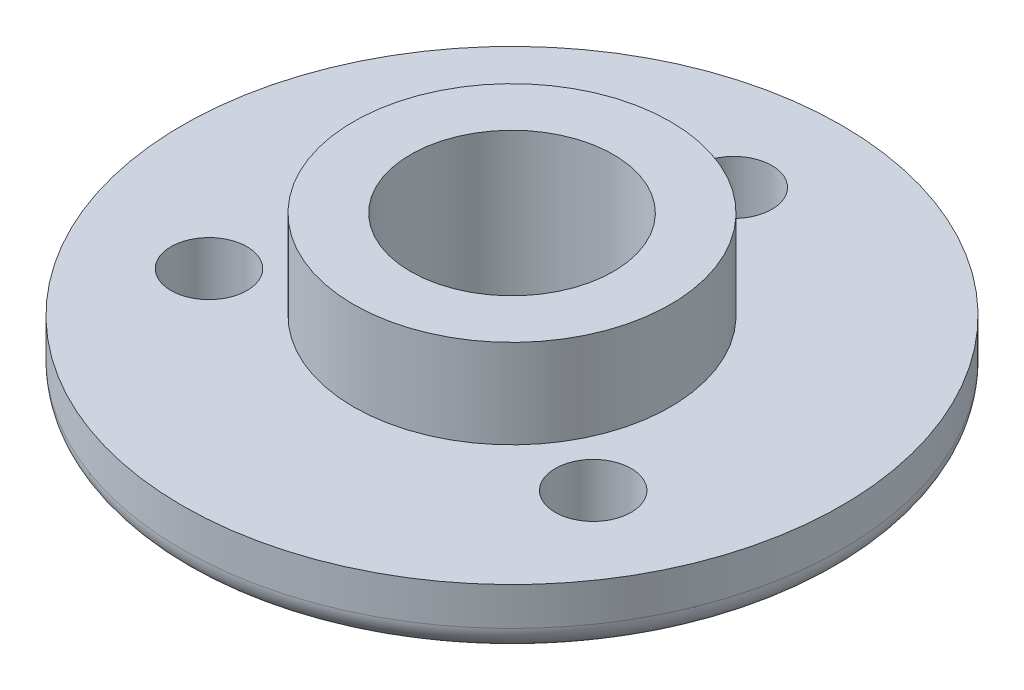
ISO-10303-21;
HEADER;
FILE_DESCRIPTION(('STEP AP214'),'2;1');
FILE_NAME('part.step','',(''),(''),'','','');
FILE_SCHEMA(('AUTOMOTIVE_DESIGN { 1 0 10303 214 1 1 1 1 }'));
ENDSEC;
DATA;
#1=APPLICATION_CONTEXT('core data for automotive mechanical design processes');
#2=APPLICATION_PROTOCOL_DEFINITION('international standard','automotive_design',2000,#1);
#3=PRODUCT_CONTEXT('',#1,'mechanical');
#4=PRODUCT('Part','Part','',(#3));
#5=PRODUCT_RELATED_PRODUCT_CATEGORY('part','',(#4));
#6=PRODUCT_DEFINITION_FORMATION('','',#4);
#7=PRODUCT_DEFINITION_CONTEXT('part definition',#1,'design');
#8=PRODUCT_DEFINITION('design','',#6,#7);
#9=PRODUCT_DEFINITION_SHAPE('','',#8);
#10=(LENGTH_UNIT() NAMED_UNIT(*) SI_UNIT(.MILLI.,.METRE.));
#11=(NAMED_UNIT(*) PLANE_ANGLE_UNIT() SI_UNIT($,.RADIAN.));
#12=(NAMED_UNIT(*) SI_UNIT($,.STERADIAN.) SOLID_ANGLE_UNIT());
#13=UNCERTAINTY_MEASURE_WITH_UNIT(LENGTH_MEASURE(1.E-05),#10,'distance_accuracy_value','');
#14=(GEOMETRIC_REPRESENTATION_CONTEXT(3) GLOBAL_UNCERTAINTY_ASSIGNED_CONTEXT((#13)) GLOBAL_UNIT_ASSIGNED_CONTEXT((#10,
#11,#12)) REPRESENTATION_CONTEXT('',''));
#15=CARTESIAN_POINT('',(0.,0.,0.));
#16=DIRECTION('',(0.,0.,1.));
#17=DIRECTION('',(1.,0.,0.));
#18=AXIS2_PLACEMENT_3D('',#15,#16,#17);
#19=CARTESIAN_POINT('',(0.,5.,0.));
#20=DIRECTION('',(0.,-1.,0.));
#21=DIRECTION('',(0.,0.,-1.));
#22=AXIS2_PLACEMENT_3D('',#19,#20,#21);
#23=CYLINDRICAL_SURFACE('',#22,26.);
#24=CARTESIAN_POINT('',(0.,2.,0.));
#25=DIRECTION('',(0.,1.,0.));
#26=DIRECTION('',(0.,0.,1.));
#27=AXIS2_PLACEMENT_3D('',#24,#25,#26);
#28=CIRCLE('',#27,26.);
#29=CARTESIAN_POINT('',(0.,2.,26.));
#30=VERTEX_POINT('',#29);
#31=EDGE_CURVE('E42',#30,#30,#28,.T.);
#32=ORIENTED_EDGE('',*,*,#31,.T.);
#33=EDGE_LOOP('',(#32));
#34=FACE_BOUND('',#33,.T.);
#35=CARTESIAN_POINT('',(0.,5.,0.));
#36=DIRECTION('',(0.,1.,0.));
#37=DIRECTION('',(0.,0.,1.));
#38=AXIS2_PLACEMENT_3D('',#35,#36,#37);
#39=CIRCLE('',#38,26.);
#40=CARTESIAN_POINT('',(0.,5.,26.));
#41=VERTEX_POINT('',#40);
#42=EDGE_CURVE('E46',#41,#41,#39,.T.);
#43=ORIENTED_EDGE('',*,*,#42,.F.);
#44=EDGE_LOOP('',(#43));
#45=FACE_BOUND('',#44,.T.);
#46=ADVANCED_FACE('F35',(#34,#45),#23,.T.);
#47=CARTESIAN_POINT('',(0.,5.,0.));
#48=DIRECTION('',(0.,1.,0.));
#49=DIRECTION('',(0.,0.,1.));
#50=AXIS2_PLACEMENT_3D('',#47,#48,#49);
#51=PLANE('',#50);
#52=CARTESIAN_POINT('',(0.,5.,0.));
#53=DIRECTION('',(0.,1.,0.));
#54=DIRECTION('',(0.,0.,1.));
#55=AXIS2_PLACEMENT_3D('',#52,#53,#54);
#56=CIRCLE('',#55,12.5);
#57=CARTESIAN_POINT('',(0.,5.,12.5));
#58=VERTEX_POINT('',#57);
#59=EDGE_CURVE('E66',#58,#58,#56,.F.);
#60=ORIENTED_EDGE('',*,*,#59,.T.);
#61=EDGE_LOOP('',(#60));
#62=FACE_BOUND('',#61,.T.);
#63=CARTESIAN_POINT('',(-15.1554445662269,5.,8.75000000000043));
#64=DIRECTION('',(0.,1.,0.));
#65=DIRECTION('',(0.,0.,1.));
#66=AXIS2_PLACEMENT_3D('',#63,#64,#65);
#67=CIRCLE('',#66,3.00000000000098);
#68=CARTESIAN_POINT('',(-15.1554445662269,5.,11.7500000000014));
#69=VERTEX_POINT('',#68);
#70=EDGE_CURVE('E60',#69,#69,#67,.T.);
#71=ORIENTED_EDGE('',*,*,#70,.F.);
#72=EDGE_LOOP('',(#71));
#73=FACE_BOUND('',#72,.T.);
#74=CARTESIAN_POINT('',(15.1554445662284,5.,8.74999999999957));
#75=DIRECTION('',(0.,1.,0.));
#76=DIRECTION('',(0.,0.,1.));
#77=AXIS2_PLACEMENT_3D('',#74,#75,#76);
#78=CIRCLE('',#77,3.00000000000067);
#79=CARTESIAN_POINT('',(15.1554445662284,5.,11.7500000000002));
#80=VERTEX_POINT('',#79);
#81=EDGE_CURVE('E65',#80,#80,#78,.T.);
#82=ORIENTED_EDGE('',*,*,#81,.F.);
#83=EDGE_LOOP('',(#82));
#84=FACE_BOUND('',#83,.T.);
#85=CARTESIAN_POINT('',(0.,5.,-17.5));
#86=DIRECTION('',(0.,1.,0.));
#87=DIRECTION('',(0.,0.,1.));
#88=AXIS2_PLACEMENT_3D('',#85,#86,#87);
#89=CIRCLE('',#88,3.);
#90=CARTESIAN_POINT('',(0.,5.,-14.5));
#91=VERTEX_POINT('',#90);
#92=EDGE_CURVE('E62',#91,#91,#89,.T.);
#93=ORIENTED_EDGE('',*,*,#92,.F.);
#94=EDGE_LOOP('',(#93));
#95=FACE_BOUND('',#94,.T.);
#96=ORIENTED_EDGE('',*,*,#42,.T.);
#97=EDGE_LOOP('',(#96));
#98=FACE_BOUND('',#97,.T.);
#99=ADVANCED_FACE('F105',(#62,#73,#84,#95,#98),#51,.T.);
#100=CARTESIAN_POINT('',(0.,0.,0.));
#101=DIRECTION('',(0.,1.,0.));
#102=DIRECTION('',(0.,0.,1.));
#103=AXIS2_PLACEMENT_3D('',#100,#101,#102);
#104=PLANE('',#103);
#105=CARTESIAN_POINT('',(0.,0.,0.));
#106=DIRECTION('',(0.,1.,0.));
#107=DIRECTION('',(0.,0.,1.));
#108=AXIS2_PLACEMENT_3D('',#105,#106,#107);
#109=CIRCLE('',#108,24.);
#110=CARTESIAN_POINT('',(0.,0.,24.));
#111=VERTEX_POINT('',#110);
#112=EDGE_CURVE('E10',#111,#111,#109,.F.);
#113=ORIENTED_EDGE('',*,*,#112,.T.);
#114=EDGE_LOOP('',(#113));
#115=FACE_BOUND('',#114,.T.);
#116=CARTESIAN_POINT('',(0.,0.,0.));
#117=DIRECTION('',(0.,1.,0.));
#118=DIRECTION('',(0.,0.,1.));
#119=AXIS2_PLACEMENT_3D('',#116,#117,#118);
#120=CIRCLE('',#119,8.);
#121=CARTESIAN_POINT('',(0.,0.,8.));
#122=VERTEX_POINT('',#121);
#123=EDGE_CURVE('E76',#122,#122,#120,.F.);
#124=ORIENTED_EDGE('',*,*,#123,.F.);
#125=EDGE_LOOP('',(#124));
#126=FACE_BOUND('',#125,.T.);
#127=CARTESIAN_POINT('',(-15.1554445662269,0.,8.75000000000043));
#128=DIRECTION('',(0.,1.,0.));
#129=DIRECTION('',(0.,0.,1.));
#130=AXIS2_PLACEMENT_3D('',#127,#128,#129);
#131=CIRCLE('',#130,3.00000000000098);
#132=CARTESIAN_POINT('',(-15.1554445662269,0.,11.7500000000014));
#133=VERTEX_POINT('',#132);
#134=EDGE_CURVE('E50',#133,#133,#131,.F.);
#135=ORIENTED_EDGE('',*,*,#134,.F.);
#136=EDGE_LOOP('',(#135));
#137=FACE_BOUND('',#136,.T.);
#138=CARTESIAN_POINT('',(15.1554445662284,0.,8.74999999999957));
#139=DIRECTION('',(0.,1.,0.));
#140=DIRECTION('',(0.,0.,1.));
#141=AXIS2_PLACEMENT_3D('',#138,#139,#140);
#142=CIRCLE('',#141,3.00000000000067);
#143=CARTESIAN_POINT('',(15.1554445662284,0.,11.7500000000002));
#144=VERTEX_POINT('',#143);
#145=EDGE_CURVE('E55',#144,#144,#142,.F.);
#146=ORIENTED_EDGE('',*,*,#145,.F.);
#147=EDGE_LOOP('',(#146));
#148=FACE_BOUND('',#147,.T.);
#149=CARTESIAN_POINT('',(0.,0.,-17.5));
#150=DIRECTION('',(0.,1.,0.));
#151=DIRECTION('',(0.,0.,1.));
#152=AXIS2_PLACEMENT_3D('',#149,#150,#151);
#153=CIRCLE('',#152,3.);
#154=CARTESIAN_POINT('',(0.,0.,-14.5));
#155=VERTEX_POINT('',#154);
#156=EDGE_CURVE('E58',#155,#155,#153,.F.);
#157=ORIENTED_EDGE('',*,*,#156,.F.);
#158=EDGE_LOOP('',(#157));
#159=FACE_BOUND('',#158,.T.);
#160=ADVANCED_FACE('F111',(#115,#126,#137,#148,#159),#104,.F.);
#161=CARTESIAN_POINT('',(0.,5.,-17.5));
#162=DIRECTION('',(0.,-1.,0.));
#163=DIRECTION('',(0.,0.,-1.));
#164=AXIS2_PLACEMENT_3D('',#161,#162,#163);
#165=CYLINDRICAL_SURFACE('',#164,3.);
#166=ORIENTED_EDGE('',*,*,#92,.T.);
#167=EDGE_LOOP('',(#166));
#168=FACE_BOUND('',#167,.T.);
#169=ORIENTED_EDGE('',*,*,#156,.T.);
#170=EDGE_LOOP('',(#169));
#171=FACE_BOUND('',#170,.T.);
#172=ADVANCED_FACE('F116',(#168,#171),#165,.F.);
#173=CARTESIAN_POINT('',(15.1554445662284,5.,8.74999999999957));
#174=DIRECTION('',(0.,-1.,0.));
#175=DIRECTION('',(0.,0.,-1.));
#176=AXIS2_PLACEMENT_3D('',#173,#174,#175);
#177=CYLINDRICAL_SURFACE('',#176,3.00000000000067);
#178=ORIENTED_EDGE('',*,*,#81,.T.);
#179=EDGE_LOOP('',(#178));
#180=FACE_BOUND('',#179,.T.);
#181=ORIENTED_EDGE('',*,*,#145,.T.);
#182=EDGE_LOOP('',(#181));
#183=FACE_BOUND('',#182,.T.);
#184=ADVANCED_FACE('F100',(#180,#183),#177,.F.);
#185=CARTESIAN_POINT('',(-15.1554445662269,5.,8.75000000000043));
#186=DIRECTION('',(0.,-1.,0.));
#187=DIRECTION('',(0.,0.,-1.));
#188=AXIS2_PLACEMENT_3D('',#185,#186,#187);
#189=CYLINDRICAL_SURFACE('',#188,3.00000000000098);
#190=ORIENTED_EDGE('',*,*,#70,.T.);
#191=EDGE_LOOP('',(#190));
#192=FACE_BOUND('',#191,.T.);
#193=ORIENTED_EDGE('',*,*,#134,.T.);
#194=EDGE_LOOP('',(#193));
#195=FACE_BOUND('',#194,.T.);
#196=ADVANCED_FACE('F94',(#192,#195),#189,.F.);
#197=CARTESIAN_POINT('',(0.,12.,0.));
#198=DIRECTION('',(0.,-1.,0.));
#199=DIRECTION('',(0.,0.,-1.));
#200=AXIS2_PLACEMENT_3D('',#197,#198,#199);
#201=CYLINDRICAL_SURFACE('',#200,12.5);
#202=ORIENTED_EDGE('',*,*,#59,.F.);
#203=EDGE_LOOP('',(#202));
#204=FACE_BOUND('',#203,.T.);
#205=CARTESIAN_POINT('',(0.,12.,0.));
#206=DIRECTION('',(0.,1.,0.));
#207=DIRECTION('',(0.,0.,1.));
#208=AXIS2_PLACEMENT_3D('',#205,#206,#207);
#209=CIRCLE('',#208,12.5);
#210=CARTESIAN_POINT('',(0.,12.,12.5));
#211=VERTEX_POINT('',#210);
#212=EDGE_CURVE('E73',#211,#211,#209,.T.);
#213=ORIENTED_EDGE('',*,*,#212,.F.);
#214=EDGE_LOOP('',(#213));
#215=FACE_BOUND('',#214,.T.);
#216=ADVANCED_FACE('F89',(#204,#215),#201,.T.);
#217=CARTESIAN_POINT('',(0.,12.,0.));
#218=DIRECTION('',(0.,1.,0.));
#219=DIRECTION('',(0.,0.,1.));
#220=AXIS2_PLACEMENT_3D('',#217,#218,#219);
#221=PLANE('',#220);
#222=CARTESIAN_POINT('',(0.,12.,0.));
#223=DIRECTION('',(0.,1.,0.));
#224=DIRECTION('',(0.,0.,1.));
#225=AXIS2_PLACEMENT_3D('',#222,#223,#224);
#226=CIRCLE('',#225,8.);
#227=CARTESIAN_POINT('',(0.,12.,8.));
#228=VERTEX_POINT('',#227);
#229=EDGE_CURVE('E79',#228,#228,#226,.T.);
#230=ORIENTED_EDGE('',*,*,#229,.F.);
#231=EDGE_LOOP('',(#230));
#232=FACE_BOUND('',#231,.T.);
#233=ORIENTED_EDGE('',*,*,#212,.T.);
#234=EDGE_LOOP('',(#233));
#235=FACE_BOUND('',#234,.T.);
#236=ADVANCED_FACE('F86',(#232,#235),#221,.T.);
#237=CARTESIAN_POINT('',(0.,12.,0.));
#238=DIRECTION('',(0.,-1.,0.));
#239=DIRECTION('',(0.,0.,-1.));
#240=AXIS2_PLACEMENT_3D('',#237,#238,#239);
#241=CYLINDRICAL_SURFACE('',#240,8.);
#242=ORIENTED_EDGE('',*,*,#229,.T.);
#243=EDGE_LOOP('',(#242));
#244=FACE_BOUND('',#243,.T.);
#245=ORIENTED_EDGE('',*,*,#123,.T.);
#246=EDGE_LOOP('',(#245));
#247=FACE_BOUND('',#246,.T.);
#248=ADVANCED_FACE('F83',(#244,#247),#241,.F.);
#249=CARTESIAN_POINT('',(0.,2.,0.));
#250=DIRECTION('',(0.,1.,0.));
#251=DIRECTION('',(0.,0.,1.));
#252=AXIS2_PLACEMENT_3D('',#249,#250,#251);
#253=TOROIDAL_SURFACE('',#252,24.,2.);
#254=ORIENTED_EDGE('',*,*,#112,.F.);
#255=EDGE_LOOP('',(#254));
#256=FACE_BOUND('',#255,.T.);
#257=ORIENTED_EDGE('',*,*,#31,.F.);
#258=EDGE_LOOP('',(#257));
#259=FACE_BOUND('',#258,.T.);
#260=ADVANCED_FACE('F37',(#256,#259),#253,.T.);
#261=CLOSED_SHELL('',(#46,#99,#160,#172,#184,#196,#216,#236,#248,#260));
#262=MANIFOLD_SOLID_BREP('B2',#261);
#263=ADVANCED_BREP_SHAPE_REPRESENTATION('',(#18,#262),#14);
#264=SHAPE_DEFINITION_REPRESENTATION(#9,#263);
ENDSEC;
END-ISO-10303-21;
